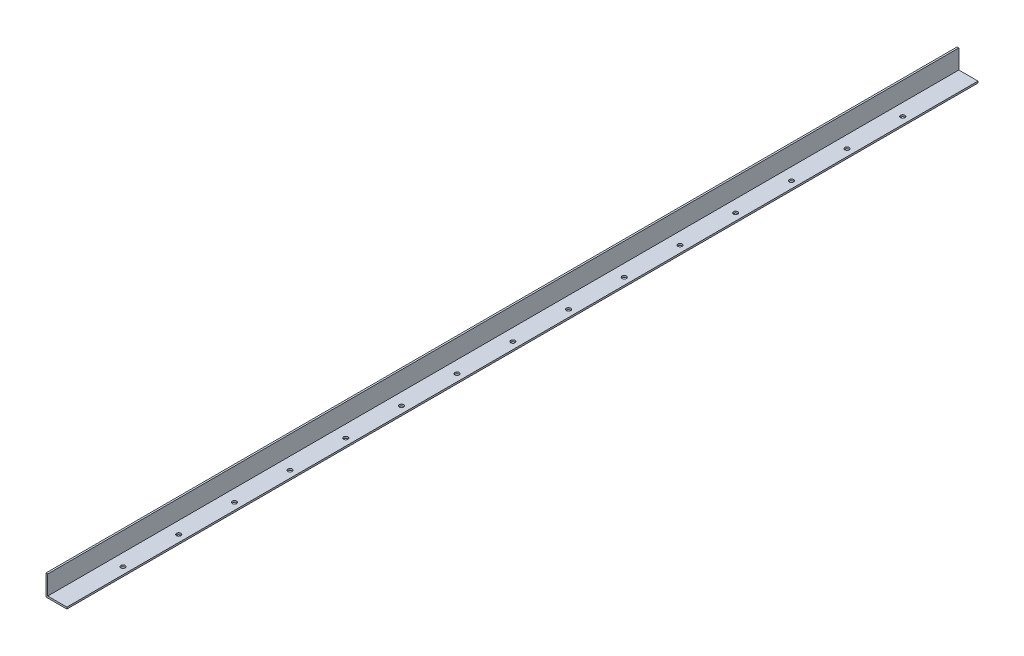
ISO-10303-21;
HEADER;
FILE_DESCRIPTION(('STEP AP214'),'2;1');
FILE_NAME('part.step','',(''),(''),'','','');
FILE_SCHEMA(('AUTOMOTIVE_DESIGN { 1 0 10303 214 1 1 1 1 }'));
ENDSEC;
DATA;
#1=APPLICATION_CONTEXT('core data for automotive mechanical design processes');
#2=APPLICATION_PROTOCOL_DEFINITION('international standard','automotive_design',2000,#1);
#3=PRODUCT_CONTEXT('',#1,'mechanical');
#4=PRODUCT('Part','Part','',(#3));
#5=PRODUCT_RELATED_PRODUCT_CATEGORY('part','',(#4));
#6=PRODUCT_DEFINITION_FORMATION('','',#4);
#7=PRODUCT_DEFINITION_CONTEXT('part definition',#1,'design');
#8=PRODUCT_DEFINITION('design','',#6,#7);
#9=PRODUCT_DEFINITION_SHAPE('','',#8);
#10=(LENGTH_UNIT() NAMED_UNIT(*) SI_UNIT(.MILLI.,.METRE.));
#11=(NAMED_UNIT(*) PLANE_ANGLE_UNIT() SI_UNIT($,.RADIAN.));
#12=(NAMED_UNIT(*) SI_UNIT($,.STERADIAN.) SOLID_ANGLE_UNIT());
#13=UNCERTAINTY_MEASURE_WITH_UNIT(LENGTH_MEASURE(1.E-05),#10,'distance_accuracy_value','');
#14=(GEOMETRIC_REPRESENTATION_CONTEXT(3) GLOBAL_UNCERTAINTY_ASSIGNED_CONTEXT((#13)) GLOBAL_UNIT_ASSIGNED_CONTEXT((#10,
#11,#12)) REPRESENTATION_CONTEXT('',''));
#15=CARTESIAN_POINT('',(0.,0.,0.));
#16=DIRECTION('',(0.,0.,1.));
#17=DIRECTION('',(1.,0.,0.));
#18=AXIS2_PLACEMENT_3D('',#15,#16,#17);
#19=CARTESIAN_POINT('',(25.4,-3.175,-706.4375));
#20=DIRECTION('',(0.,-1.,0.));
#21=DIRECTION('',(0.,0.,-1.));
#22=AXIS2_PLACEMENT_3D('',#19,#20,#21);
#23=CYLINDRICAL_SURFACE('',#22,3.96875);
#24=CARTESIAN_POINT('',(25.4,3.175,-706.4375));
#25=DIRECTION('',(0.,-1.,0.));
#26=DIRECTION('',(0.,0.,-1.));
#27=AXIS2_PLACEMENT_3D('',#24,#25,#26);
#28=CIRCLE('',#27,3.96875);
#29=CARTESIAN_POINT('',(25.4,3.175,-710.40625));
#30=VERTEX_POINT('',#29);
#31=EDGE_CURVE('E20',#30,#30,#28,.T.);
#32=ORIENTED_EDGE('',*,*,#31,.F.);
#33=EDGE_LOOP('',(#32));
#34=FACE_BOUND('',#33,.T.);
#35=CARTESIAN_POINT('',(25.4,0.,-706.4375));
#36=DIRECTION('',(0.,-1.,0.));
#37=DIRECTION('',(0.,0.,-1.));
#38=AXIS2_PLACEMENT_3D('',#35,#36,#37);
#39=CIRCLE('',#38,3.96875);
#40=CARTESIAN_POINT('',(25.4,0.,-710.40625));
#41=VERTEX_POINT('',#40);
#42=EDGE_CURVE('E101',#41,#41,#39,.F.);
#43=ORIENTED_EDGE('',*,*,#42,.F.);
#44=EDGE_LOOP('',(#43));
#45=FACE_BOUND('',#44,.T.);
#46=ADVANCED_FACE('F17',(#34,#45),#23,.F.);
#47=CARTESIAN_POINT('',(25.4,-3.175,-604.8375));
#48=DIRECTION('',(0.,-1.,0.));
#49=DIRECTION('',(0.,0.,-1.));
#50=AXIS2_PLACEMENT_3D('',#47,#48,#49);
#51=CYLINDRICAL_SURFACE('',#50,3.96875);
#52=CARTESIAN_POINT('',(25.4,3.175,-604.8375));
#53=DIRECTION('',(0.,-1.,0.));
#54=DIRECTION('',(0.,0.,-1.));
#55=AXIS2_PLACEMENT_3D('',#52,#53,#54);
#56=CIRCLE('',#55,3.96875);
#57=CARTESIAN_POINT('',(25.4,3.175,-608.80625));
#58=VERTEX_POINT('',#57);
#59=EDGE_CURVE('E181',#58,#58,#56,.T.);
#60=ORIENTED_EDGE('',*,*,#59,.F.);
#61=EDGE_LOOP('',(#60));
#62=FACE_BOUND('',#61,.T.);
#63=CARTESIAN_POINT('',(25.4,0.,-604.8375));
#64=DIRECTION('',(0.,-1.,0.));
#65=DIRECTION('',(0.,0.,-1.));
#66=AXIS2_PLACEMENT_3D('',#63,#64,#65);
#67=CIRCLE('',#66,3.96875);
#68=CARTESIAN_POINT('',(25.4,0.,-608.80625));
#69=VERTEX_POINT('',#68);
#70=EDGE_CURVE('E139',#69,#69,#67,.F.);
#71=ORIENTED_EDGE('',*,*,#70,.F.);
#72=EDGE_LOOP('',(#71));
#73=FACE_BOUND('',#72,.T.);
#74=ADVANCED_FACE('F191',(#62,#73),#51,.F.);
#75=CARTESIAN_POINT('',(25.4,-3.175,-503.2375));
#76=DIRECTION('',(0.,-1.,0.));
#77=DIRECTION('',(0.,0.,-1.));
#78=AXIS2_PLACEMENT_3D('',#75,#76,#77);
#79=CYLINDRICAL_SURFACE('',#78,3.96875);
#80=CARTESIAN_POINT('',(25.4,3.175,-503.2375));
#81=DIRECTION('',(0.,-1.,0.));
#82=DIRECTION('',(0.,0.,-1.));
#83=AXIS2_PLACEMENT_3D('',#80,#81,#82);
#84=CIRCLE('',#83,3.96875);
#85=CARTESIAN_POINT('',(25.4,3.175,-507.20625));
#86=VERTEX_POINT('',#85);
#87=EDGE_CURVE('E179',#86,#86,#84,.T.);
#88=ORIENTED_EDGE('',*,*,#87,.F.);
#89=EDGE_LOOP('',(#88));
#90=FACE_BOUND('',#89,.T.);
#91=CARTESIAN_POINT('',(25.4,0.,-503.2375));
#92=DIRECTION('',(0.,-1.,0.));
#93=DIRECTION('',(0.,0.,-1.));
#94=AXIS2_PLACEMENT_3D('',#91,#92,#93);
#95=CIRCLE('',#94,3.96875);
#96=CARTESIAN_POINT('',(25.4,0.,-507.20625));
#97=VERTEX_POINT('',#96);
#98=EDGE_CURVE('E136',#97,#97,#95,.F.);
#99=ORIENTED_EDGE('',*,*,#98,.F.);
#100=EDGE_LOOP('',(#99));
#101=FACE_BOUND('',#100,.T.);
#102=ADVANCED_FACE('F415',(#90,#101),#79,.F.);
#103=CARTESIAN_POINT('',(25.4,-3.175,-401.6375));
#104=DIRECTION('',(0.,-1.,0.));
#105=DIRECTION('',(0.,0.,-1.));
#106=AXIS2_PLACEMENT_3D('',#103,#104,#105);
#107=CYLINDRICAL_SURFACE('',#106,3.96875);
#108=CARTESIAN_POINT('',(25.4,3.175,-401.6375));
#109=DIRECTION('',(0.,-1.,0.));
#110=DIRECTION('',(0.,0.,-1.));
#111=AXIS2_PLACEMENT_3D('',#108,#109,#110);
#112=CIRCLE('',#111,3.96875);
#113=CARTESIAN_POINT('',(25.4,3.175,-405.60625));
#114=VERTEX_POINT('',#113);
#115=EDGE_CURVE('E176',#114,#114,#112,.T.);
#116=ORIENTED_EDGE('',*,*,#115,.F.);
#117=EDGE_LOOP('',(#116));
#118=FACE_BOUND('',#117,.T.);
#119=CARTESIAN_POINT('',(25.4,0.,-401.6375));
#120=DIRECTION('',(0.,-1.,0.));
#121=DIRECTION('',(0.,0.,-1.));
#122=AXIS2_PLACEMENT_3D('',#119,#120,#121);
#123=CIRCLE('',#122,3.96875);
#124=CARTESIAN_POINT('',(25.4,0.,-405.60625));
#125=VERTEX_POINT('',#124);
#126=EDGE_CURVE('E133',#125,#125,#123,.F.);
#127=ORIENTED_EDGE('',*,*,#126,.F.);
#128=EDGE_LOOP('',(#127));
#129=FACE_BOUND('',#128,.T.);
#130=ADVANCED_FACE('F405',(#118,#129),#107,.F.);
#131=CARTESIAN_POINT('',(25.4,-3.175,-300.0375));
#132=DIRECTION('',(0.,-1.,0.));
#133=DIRECTION('',(0.,0.,-1.));
#134=AXIS2_PLACEMENT_3D('',#131,#132,#133);
#135=CYLINDRICAL_SURFACE('',#134,3.96875);
#136=CARTESIAN_POINT('',(25.4,3.175,-300.0375));
#137=DIRECTION('',(0.,-1.,0.));
#138=DIRECTION('',(0.,0.,-1.));
#139=AXIS2_PLACEMENT_3D('',#136,#137,#138);
#140=CIRCLE('',#139,3.96875);
#141=CARTESIAN_POINT('',(25.4,3.175,-304.00625));
#142=VERTEX_POINT('',#141);
#143=EDGE_CURVE('E173',#142,#142,#140,.T.);
#144=ORIENTED_EDGE('',*,*,#143,.F.);
#145=EDGE_LOOP('',(#144));
#146=FACE_BOUND('',#145,.T.);
#147=CARTESIAN_POINT('',(25.4,0.,-300.0375));
#148=DIRECTION('',(0.,-1.,0.));
#149=DIRECTION('',(0.,0.,-1.));
#150=AXIS2_PLACEMENT_3D('',#147,#148,#149);
#151=CIRCLE('',#150,3.96875);
#152=CARTESIAN_POINT('',(25.4,0.,-304.00625));
#153=VERTEX_POINT('',#152);
#154=EDGE_CURVE('E130',#153,#153,#151,.F.);
#155=ORIENTED_EDGE('',*,*,#154,.F.);
#156=EDGE_LOOP('',(#155));
#157=FACE_BOUND('',#156,.T.);
#158=ADVANCED_FACE('F395',(#146,#157),#135,.F.);
#159=CARTESIAN_POINT('',(25.4,-3.175,-198.4375));
#160=DIRECTION('',(0.,-1.,0.));
#161=DIRECTION('',(0.,0.,-1.));
#162=AXIS2_PLACEMENT_3D('',#159,#160,#161);
#163=CYLINDRICAL_SURFACE('',#162,3.96875);
#164=CARTESIAN_POINT('',(25.4,3.175,-198.4375));
#165=DIRECTION('',(0.,-1.,0.));
#166=DIRECTION('',(0.,0.,-1.));
#167=AXIS2_PLACEMENT_3D('',#164,#165,#166);
#168=CIRCLE('',#167,3.96875);
#169=CARTESIAN_POINT('',(25.4,3.175,-202.40625));
#170=VERTEX_POINT('',#169);
#171=EDGE_CURVE('E170',#170,#170,#168,.T.);
#172=ORIENTED_EDGE('',*,*,#171,.F.);
#173=EDGE_LOOP('',(#172));
#174=FACE_BOUND('',#173,.T.);
#175=CARTESIAN_POINT('',(25.4,0.,-198.4375));
#176=DIRECTION('',(0.,-1.,0.));
#177=DIRECTION('',(0.,0.,-1.));
#178=AXIS2_PLACEMENT_3D('',#175,#176,#177);
#179=CIRCLE('',#178,3.96875);
#180=CARTESIAN_POINT('',(25.4,0.,-202.40625));
#181=VERTEX_POINT('',#180);
#182=EDGE_CURVE('E127',#181,#181,#179,.F.);
#183=ORIENTED_EDGE('',*,*,#182,.F.);
#184=EDGE_LOOP('',(#183));
#185=FACE_BOUND('',#184,.T.);
#186=ADVANCED_FACE('F385',(#174,#185),#163,.F.);
#187=CARTESIAN_POINT('',(25.4,-3.175,-96.8375));
#188=DIRECTION('',(0.,-1.,0.));
#189=DIRECTION('',(0.,0.,-1.));
#190=AXIS2_PLACEMENT_3D('',#187,#188,#189);
#191=CYLINDRICAL_SURFACE('',#190,3.96875);
#192=CARTESIAN_POINT('',(25.4,3.175,-96.8375));
#193=DIRECTION('',(0.,-1.,0.));
#194=DIRECTION('',(0.,0.,-1.));
#195=AXIS2_PLACEMENT_3D('',#192,#193,#194);
#196=CIRCLE('',#195,3.96875);
#197=CARTESIAN_POINT('',(25.4,3.175,-100.80625));
#198=VERTEX_POINT('',#197);
#199=EDGE_CURVE('E167',#198,#198,#196,.T.);
#200=ORIENTED_EDGE('',*,*,#199,.F.);
#201=EDGE_LOOP('',(#200));
#202=FACE_BOUND('',#201,.T.);
#203=CARTESIAN_POINT('',(25.4,0.,-96.8375));
#204=DIRECTION('',(0.,-1.,0.));
#205=DIRECTION('',(0.,0.,-1.));
#206=AXIS2_PLACEMENT_3D('',#203,#204,#205);
#207=CIRCLE('',#206,3.96875);
#208=CARTESIAN_POINT('',(25.4,0.,-100.80625));
#209=VERTEX_POINT('',#208);
#210=EDGE_CURVE('E124',#209,#209,#207,.F.);
#211=ORIENTED_EDGE('',*,*,#210,.F.);
#212=EDGE_LOOP('',(#211));
#213=FACE_BOUND('',#212,.T.);
#214=ADVANCED_FACE('F375',(#202,#213),#191,.F.);
#215=CARTESIAN_POINT('',(25.4,-3.175,4.7625));
#216=DIRECTION('',(0.,-1.,0.));
#217=DIRECTION('',(0.,0.,-1.));
#218=AXIS2_PLACEMENT_3D('',#215,#216,#217);
#219=CYLINDRICAL_SURFACE('',#218,3.96875);
#220=CARTESIAN_POINT('',(25.4,3.175,4.7625));
#221=DIRECTION('',(0.,-1.,0.));
#222=DIRECTION('',(0.,0.,-1.));
#223=AXIS2_PLACEMENT_3D('',#220,#221,#222);
#224=CIRCLE('',#223,3.96875);
#225=CARTESIAN_POINT('',(25.4,3.175,0.793749999999999));
#226=VERTEX_POINT('',#225);
#227=EDGE_CURVE('E164',#226,#226,#224,.T.);
#228=ORIENTED_EDGE('',*,*,#227,.F.);
#229=EDGE_LOOP('',(#228));
#230=FACE_BOUND('',#229,.T.);
#231=CARTESIAN_POINT('',(25.4,0.,4.7625));
#232=DIRECTION('',(0.,-1.,0.));
#233=DIRECTION('',(0.,0.,-1.));
#234=AXIS2_PLACEMENT_3D('',#231,#232,#233);
#235=CIRCLE('',#234,3.96875);
#236=CARTESIAN_POINT('',(25.4,0.,0.793749999999999));
#237=VERTEX_POINT('',#236);
#238=EDGE_CURVE('E121',#237,#237,#235,.F.);
#239=ORIENTED_EDGE('',*,*,#238,.F.);
#240=EDGE_LOOP('',(#239));
#241=FACE_BOUND('',#240,.T.);
#242=ADVANCED_FACE('F365',(#230,#241),#219,.F.);
#243=CARTESIAN_POINT('',(25.4,-3.175,106.3625));
#244=DIRECTION('',(0.,-1.,0.));
#245=DIRECTION('',(0.,0.,-1.));
#246=AXIS2_PLACEMENT_3D('',#243,#244,#245);
#247=CYLINDRICAL_SURFACE('',#246,3.96875);
#248=CARTESIAN_POINT('',(25.4,3.175,106.3625));
#249=DIRECTION('',(0.,-1.,0.));
#250=DIRECTION('',(0.,0.,-1.));
#251=AXIS2_PLACEMENT_3D('',#248,#249,#250);
#252=CIRCLE('',#251,3.96875);
#253=CARTESIAN_POINT('',(25.4,3.175,102.39375));
#254=VERTEX_POINT('',#253);
#255=EDGE_CURVE('E161',#254,#254,#252,.T.);
#256=ORIENTED_EDGE('',*,*,#255,.F.);
#257=EDGE_LOOP('',(#256));
#258=FACE_BOUND('',#257,.T.);
#259=CARTESIAN_POINT('',(25.4,0.,106.3625));
#260=DIRECTION('',(0.,-1.,0.));
#261=DIRECTION('',(0.,0.,-1.));
#262=AXIS2_PLACEMENT_3D('',#259,#260,#261);
#263=CIRCLE('',#262,3.96875);
#264=CARTESIAN_POINT('',(25.4,0.,102.39375));
#265=VERTEX_POINT('',#264);
#266=EDGE_CURVE('E118',#265,#265,#263,.F.);
#267=ORIENTED_EDGE('',*,*,#266,.F.);
#268=EDGE_LOOP('',(#267));
#269=FACE_BOUND('',#268,.T.);
#270=ADVANCED_FACE('F355',(#258,#269),#247,.F.);
#271=CARTESIAN_POINT('',(25.4,-3.175,207.9625));
#272=DIRECTION('',(0.,-1.,0.));
#273=DIRECTION('',(0.,0.,-1.));
#274=AXIS2_PLACEMENT_3D('',#271,#272,#273);
#275=CYLINDRICAL_SURFACE('',#274,3.96875);
#276=CARTESIAN_POINT('',(25.4,3.175,207.9625));
#277=DIRECTION('',(0.,-1.,0.));
#278=DIRECTION('',(0.,0.,-1.));
#279=AXIS2_PLACEMENT_3D('',#276,#277,#278);
#280=CIRCLE('',#279,3.96875);
#281=CARTESIAN_POINT('',(25.4,3.175,203.99375));
#282=VERTEX_POINT('',#281);
#283=EDGE_CURVE('E158',#282,#282,#280,.T.);
#284=ORIENTED_EDGE('',*,*,#283,.F.);
#285=EDGE_LOOP('',(#284));
#286=FACE_BOUND('',#285,.T.);
#287=CARTESIAN_POINT('',(25.4,0.,207.9625));
#288=DIRECTION('',(0.,-1.,0.));
#289=DIRECTION('',(0.,0.,-1.));
#290=AXIS2_PLACEMENT_3D('',#287,#288,#289);
#291=CIRCLE('',#290,3.96875);
#292=CARTESIAN_POINT('',(25.4,0.,203.99375));
#293=VERTEX_POINT('',#292);
#294=EDGE_CURVE('E115',#293,#293,#291,.F.);
#295=ORIENTED_EDGE('',*,*,#294,.F.);
#296=EDGE_LOOP('',(#295));
#297=FACE_BOUND('',#296,.T.);
#298=ADVANCED_FACE('F345',(#286,#297),#275,.F.);
#299=CARTESIAN_POINT('',(25.4,-3.175,309.5625));
#300=DIRECTION('',(0.,-1.,0.));
#301=DIRECTION('',(0.,0.,-1.));
#302=AXIS2_PLACEMENT_3D('',#299,#300,#301);
#303=CYLINDRICAL_SURFACE('',#302,3.96875);
#304=CARTESIAN_POINT('',(25.4,3.175,309.5625));
#305=DIRECTION('',(0.,-1.,0.));
#306=DIRECTION('',(0.,0.,-1.));
#307=AXIS2_PLACEMENT_3D('',#304,#305,#306);
#308=CIRCLE('',#307,3.96875);
#309=CARTESIAN_POINT('',(25.4,3.175,305.59375));
#310=VERTEX_POINT('',#309);
#311=EDGE_CURVE('E155',#310,#310,#308,.T.);
#312=ORIENTED_EDGE('',*,*,#311,.F.);
#313=EDGE_LOOP('',(#312));
#314=FACE_BOUND('',#313,.T.);
#315=CARTESIAN_POINT('',(25.4,0.,309.5625));
#316=DIRECTION('',(0.,-1.,0.));
#317=DIRECTION('',(0.,0.,-1.));
#318=AXIS2_PLACEMENT_3D('',#315,#316,#317);
#319=CIRCLE('',#318,3.96875);
#320=CARTESIAN_POINT('',(25.4,0.,305.59375));
#321=VERTEX_POINT('',#320);
#322=EDGE_CURVE('E112',#321,#321,#319,.F.);
#323=ORIENTED_EDGE('',*,*,#322,.F.);
#324=EDGE_LOOP('',(#323));
#325=FACE_BOUND('',#324,.T.);
#326=ADVANCED_FACE('F335',(#314,#325),#303,.F.);
#327=CARTESIAN_POINT('',(25.4,-3.175,411.1625));
#328=DIRECTION('',(0.,-1.,0.));
#329=DIRECTION('',(0.,0.,-1.));
#330=AXIS2_PLACEMENT_3D('',#327,#328,#329);
#331=CYLINDRICAL_SURFACE('',#330,3.96875);
#332=CARTESIAN_POINT('',(25.4,3.175,411.1625));
#333=DIRECTION('',(0.,-1.,0.));
#334=DIRECTION('',(0.,0.,-1.));
#335=AXIS2_PLACEMENT_3D('',#332,#333,#334);
#336=CIRCLE('',#335,3.96875);
#337=CARTESIAN_POINT('',(25.4,3.175,407.19375));
#338=VERTEX_POINT('',#337);
#339=EDGE_CURVE('E152',#338,#338,#336,.T.);
#340=ORIENTED_EDGE('',*,*,#339,.F.);
#341=EDGE_LOOP('',(#340));
#342=FACE_BOUND('',#341,.T.);
#343=CARTESIAN_POINT('',(25.4,0.,411.1625));
#344=DIRECTION('',(0.,-1.,0.));
#345=DIRECTION('',(0.,0.,-1.));
#346=AXIS2_PLACEMENT_3D('',#343,#344,#345);
#347=CIRCLE('',#346,3.96875);
#348=CARTESIAN_POINT('',(25.4,0.,407.19375));
#349=VERTEX_POINT('',#348);
#350=EDGE_CURVE('E109',#349,#349,#347,.F.);
#351=ORIENTED_EDGE('',*,*,#350,.F.);
#352=EDGE_LOOP('',(#351));
#353=FACE_BOUND('',#352,.T.);
#354=ADVANCED_FACE('F325',(#342,#353),#331,.F.);
#355=CARTESIAN_POINT('',(25.4,-3.175,512.7625));
#356=DIRECTION('',(0.,-1.,0.));
#357=DIRECTION('',(0.,0.,-1.));
#358=AXIS2_PLACEMENT_3D('',#355,#356,#357);
#359=CYLINDRICAL_SURFACE('',#358,3.96875);
#360=CARTESIAN_POINT('',(25.4,3.175,512.7625));
#361=DIRECTION('',(0.,-1.,0.));
#362=DIRECTION('',(0.,0.,-1.));
#363=AXIS2_PLACEMENT_3D('',#360,#361,#362);
#364=CIRCLE('',#363,3.96875);
#365=CARTESIAN_POINT('',(25.4,3.175,508.79375));
#366=VERTEX_POINT('',#365);
#367=EDGE_CURVE('E149',#366,#366,#364,.T.);
#368=ORIENTED_EDGE('',*,*,#367,.F.);
#369=EDGE_LOOP('',(#368));
#370=FACE_BOUND('',#369,.T.);
#371=CARTESIAN_POINT('',(25.4,0.,512.7625));
#372=DIRECTION('',(0.,-1.,0.));
#373=DIRECTION('',(0.,0.,-1.));
#374=AXIS2_PLACEMENT_3D('',#371,#372,#373);
#375=CIRCLE('',#374,3.96875);
#376=CARTESIAN_POINT('',(25.4,0.,508.79375));
#377=VERTEX_POINT('',#376);
#378=EDGE_CURVE('E106',#377,#377,#375,.F.);
#379=ORIENTED_EDGE('',*,*,#378,.F.);
#380=EDGE_LOOP('',(#379));
#381=FACE_BOUND('',#380,.T.);
#382=ADVANCED_FACE('F315',(#370,#381),#359,.F.);
#383=CARTESIAN_POINT('',(25.4,-3.175,614.3625));
#384=DIRECTION('',(0.,-1.,0.));
#385=DIRECTION('',(0.,0.,-1.));
#386=AXIS2_PLACEMENT_3D('',#383,#384,#385);
#387=CYLINDRICAL_SURFACE('',#386,3.96875);
#388=CARTESIAN_POINT('',(25.4,3.175,614.3625));
#389=DIRECTION('',(0.,-1.,0.));
#390=DIRECTION('',(0.,0.,-1.));
#391=AXIS2_PLACEMENT_3D('',#388,#389,#390);
#392=CIRCLE('',#391,3.96875);
#393=CARTESIAN_POINT('',(25.4,3.175,610.39375));
#394=VERTEX_POINT('',#393);
#395=EDGE_CURVE('E146',#394,#394,#392,.T.);
#396=ORIENTED_EDGE('',*,*,#395,.F.);
#397=EDGE_LOOP('',(#396));
#398=FACE_BOUND('',#397,.T.);
#399=CARTESIAN_POINT('',(25.4,0.,614.3625));
#400=DIRECTION('',(0.,-1.,0.));
#401=DIRECTION('',(0.,0.,-1.));
#402=AXIS2_PLACEMENT_3D('',#399,#400,#401);
#403=CIRCLE('',#402,3.96875);
#404=CARTESIAN_POINT('',(25.4,0.,610.39375));
#405=VERTEX_POINT('',#404);
#406=EDGE_CURVE('E95',#405,#405,#403,.F.);
#407=ORIENTED_EDGE('',*,*,#406,.F.);
#408=EDGE_LOOP('',(#407));
#409=FACE_BOUND('',#408,.T.);
#410=ADVANCED_FACE('F305',(#398,#409),#387,.F.);
#411=CARTESIAN_POINT('',(25.4,-3.175,715.9625));
#412=DIRECTION('',(0.,-1.,0.));
#413=DIRECTION('',(0.,0.,-1.));
#414=AXIS2_PLACEMENT_3D('',#411,#412,#413);
#415=CYLINDRICAL_SURFACE('',#414,3.96875);
#416=CARTESIAN_POINT('',(25.4,3.175,715.9625));
#417=DIRECTION('',(0.,-1.,0.));
#418=DIRECTION('',(0.,0.,-1.));
#419=AXIS2_PLACEMENT_3D('',#416,#417,#418);
#420=CIRCLE('',#419,3.96875);
#421=CARTESIAN_POINT('',(25.4,3.175,711.99375));
#422=VERTEX_POINT('',#421);
#423=EDGE_CURVE('E102',#422,#422,#420,.T.);
#424=ORIENTED_EDGE('',*,*,#423,.F.);
#425=EDGE_LOOP('',(#424));
#426=FACE_BOUND('',#425,.T.);
#427=CARTESIAN_POINT('',(25.4,0.,715.9625));
#428=DIRECTION('',(0.,-1.,0.));
#429=DIRECTION('',(0.,0.,-1.));
#430=AXIS2_PLACEMENT_3D('',#427,#428,#429);
#431=CIRCLE('',#430,3.96875);
#432=CARTESIAN_POINT('',(25.4,0.,711.99375));
#433=VERTEX_POINT('',#432);
#434=EDGE_CURVE('E92',#433,#433,#431,.F.);
#435=ORIENTED_EDGE('',*,*,#434,.F.);
#436=EDGE_LOOP('',(#435));
#437=FACE_BOUND('',#436,.T.);
#438=ADVANCED_FACE('F296',(#426,#437),#415,.F.);
#439=CARTESIAN_POINT('',(38.1,0.,-831.05625));
#440=DIRECTION('',(1.,0.,0.));
#441=DIRECTION('',(0.,0.,-1.));
#442=AXIS2_PLACEMENT_3D('',#439,#440,#441);
#443=PLANE('',#442);
#444=DIRECTION('',(0.,0.,-1.));
#445=VECTOR('',#444,1.);
#446=CARTESIAN_POINT('',(38.1,0.,-831.05625));
#447=LINE('',#446,#445);
#448=CARTESIAN_POINT('',(38.1,0.,-831.05625));
#449=VERTEX_POINT('',#448);
#450=CARTESIAN_POINT('',(38.1,0.,831.05625));
#451=VERTEX_POINT('',#450);
#452=EDGE_CURVE('E99',#449,#451,#447,.F.);
#453=ORIENTED_EDGE('',*,*,#452,.F.);
#454=DIRECTION('',(0.,1.,0.));
#455=VECTOR('',#454,1.);
#456=CARTESIAN_POINT('',(38.1,0.,-831.05625));
#457=LINE('',#456,#455);
#458=CARTESIAN_POINT('',(38.1,3.175,-831.05625));
#459=VERTEX_POINT('',#458);
#460=EDGE_CURVE('E75',#449,#459,#457,.T.);
#461=ORIENTED_EDGE('',*,*,#460,.T.);
#462=DIRECTION('',(0.,0.,1.));
#463=VECTOR('',#462,1.);
#464=CARTESIAN_POINT('',(38.1,3.175,-831.05625));
#465=LINE('',#464,#463);
#466=CARTESIAN_POINT('',(38.1,3.175,831.05625));
#467=VERTEX_POINT('',#466);
#468=EDGE_CURVE('E71',#467,#459,#465,.F.);
#469=ORIENTED_EDGE('',*,*,#468,.F.);
#470=DIRECTION('',(0.,1.,0.));
#471=VECTOR('',#470,1.);
#472=CARTESIAN_POINT('',(38.1,0.,831.05625));
#473=LINE('',#472,#471);
#474=EDGE_CURVE('E68',#451,#467,#473,.T.);
#475=ORIENTED_EDGE('',*,*,#474,.F.);
#476=EDGE_LOOP('',(#453,#461,#469,#475));
#477=FACE_BOUND('',#476,.T.);
#478=ADVANCED_FACE('F73',(#477),#443,.T.);
#479=CARTESIAN_POINT('',(38.1,3.175,-831.05625));
#480=DIRECTION('',(0.,1.,0.));
#481=DIRECTION('',(0.,0.,1.));
#482=AXIS2_PLACEMENT_3D('',#479,#480,#481);
#483=PLANE('',#482);
#484=ORIENTED_EDGE('',*,*,#423,.T.);
#485=EDGE_LOOP('',(#484));
#486=FACE_BOUND('',#485,.T.);
#487=ORIENTED_EDGE('',*,*,#395,.T.);
#488=EDGE_LOOP('',(#487));
#489=FACE_BOUND('',#488,.T.);
#490=ORIENTED_EDGE('',*,*,#367,.T.);
#491=EDGE_LOOP('',(#490));
#492=FACE_BOUND('',#491,.T.);
#493=ORIENTED_EDGE('',*,*,#339,.T.);
#494=EDGE_LOOP('',(#493));
#495=FACE_BOUND('',#494,.T.);
#496=ORIENTED_EDGE('',*,*,#311,.T.);
#497=EDGE_LOOP('',(#496));
#498=FACE_BOUND('',#497,.T.);
#499=ORIENTED_EDGE('',*,*,#283,.T.);
#500=EDGE_LOOP('',(#499));
#501=FACE_BOUND('',#500,.T.);
#502=ORIENTED_EDGE('',*,*,#255,.T.);
#503=EDGE_LOOP('',(#502));
#504=FACE_BOUND('',#503,.T.);
#505=ORIENTED_EDGE('',*,*,#227,.T.);
#506=EDGE_LOOP('',(#505));
#507=FACE_BOUND('',#506,.T.);
#508=ORIENTED_EDGE('',*,*,#199,.T.);
#509=EDGE_LOOP('',(#508));
#510=FACE_BOUND('',#509,.T.);
#511=ORIENTED_EDGE('',*,*,#171,.T.);
#512=EDGE_LOOP('',(#511));
#513=FACE_BOUND('',#512,.T.);
#514=ORIENTED_EDGE('',*,*,#143,.T.);
#515=EDGE_LOOP('',(#514));
#516=FACE_BOUND('',#515,.T.);
#517=ORIENTED_EDGE('',*,*,#115,.T.);
#518=EDGE_LOOP('',(#517));
#519=FACE_BOUND('',#518,.T.);
#520=ORIENTED_EDGE('',*,*,#87,.T.);
#521=EDGE_LOOP('',(#520));
#522=FACE_BOUND('',#521,.T.);
#523=ORIENTED_EDGE('',*,*,#59,.T.);
#524=EDGE_LOOP('',(#523));
#525=FACE_BOUND('',#524,.T.);
#526=ORIENTED_EDGE('',*,*,#31,.T.);
#527=EDGE_LOOP('',(#526));
#528=FACE_BOUND('',#527,.T.);
#529=ORIENTED_EDGE('',*,*,#468,.T.);
#530=DIRECTION('',(1.,0.,0.));
#531=VECTOR('',#530,1.);
#532=CARTESIAN_POINT('',(0.,3.175,-831.05625));
#533=LINE('',#532,#531);
#534=CARTESIAN_POINT('',(3.175,3.175,-831.05625));
#535=VERTEX_POINT('',#534);
#536=EDGE_CURVE('E222',#459,#535,#533,.F.);
#537=ORIENTED_EDGE('',*,*,#536,.T.);
#538=DIRECTION('',(0.,0.,-1.));
#539=VECTOR('',#538,1.);
#540=CARTESIAN_POINT('',(3.175,3.175,-831.05625));
#541=LINE('',#540,#539);
#542=CARTESIAN_POINT('',(3.175,3.175,831.05625));
#543=VERTEX_POINT('',#542);
#544=EDGE_CURVE('E83',#543,#535,#541,.T.);
#545=ORIENTED_EDGE('',*,*,#544,.F.);
#546=DIRECTION('',(1.,0.,0.));
#547=VECTOR('',#546,1.);
#548=CARTESIAN_POINT('',(0.,3.175,831.05625));
#549=LINE('',#548,#547);
#550=EDGE_CURVE('E80',#467,#543,#549,.F.);
#551=ORIENTED_EDGE('',*,*,#550,.F.);
#552=EDGE_LOOP('',(#529,#537,#545,#551));
#553=FACE_BOUND('',#552,.T.);
#554=ADVANCED_FACE('F81',(#486,#489,#492,#495,#498,#501,#504,#507,#510,#513,#516,#519,#522,#525,
#528,#553),#483,.T.);
#555=CARTESIAN_POINT('',(3.175,3.175,-831.05625));
#556=DIRECTION('',(1.,0.,0.));
#557=DIRECTION('',(0.,0.,-1.));
#558=AXIS2_PLACEMENT_3D('',#555,#556,#557);
#559=PLANE('',#558);
#560=ORIENTED_EDGE('',*,*,#544,.T.);
#561=DIRECTION('',(0.,1.,0.));
#562=VECTOR('',#561,1.);
#563=CARTESIAN_POINT('',(3.175,0.,-831.05625));
#564=LINE('',#563,#562);
#565=CARTESIAN_POINT('',(3.175,38.1,-831.05625));
#566=VERTEX_POINT('',#565);
#567=EDGE_CURVE('E220',#535,#566,#564,.T.);
#568=ORIENTED_EDGE('',*,*,#567,.T.);
#569=DIRECTION('',(0.,0.,1.));
#570=VECTOR('',#569,1.);
#571=CARTESIAN_POINT('',(3.175,38.1,-831.05625));
#572=LINE('',#571,#570);
#573=CARTESIAN_POINT('',(3.175,38.1,831.05625));
#574=VERTEX_POINT('',#573);
#575=EDGE_CURVE('E212',#574,#566,#572,.F.);
#576=ORIENTED_EDGE('',*,*,#575,.F.);
#577=DIRECTION('',(0.,1.,0.));
#578=VECTOR('',#577,1.);
#579=CARTESIAN_POINT('',(3.175,0.,831.05625));
#580=LINE('',#579,#578);
#581=EDGE_CURVE('E86',#543,#574,#580,.T.);
#582=ORIENTED_EDGE('',*,*,#581,.F.);
#583=EDGE_LOOP('',(#560,#568,#576,#582));
#584=FACE_BOUND('',#583,.T.);
#585=ADVANCED_FACE('F197',(#584),#559,.T.);
#586=CARTESIAN_POINT('',(0.,0.,-831.05625));
#587=DIRECTION('',(0.,-1.,0.));
#588=DIRECTION('',(0.,0.,-1.));
#589=AXIS2_PLACEMENT_3D('',#586,#587,#588);
#590=PLANE('',#589);
#591=ORIENTED_EDGE('',*,*,#434,.T.);
#592=EDGE_LOOP('',(#591));
#593=FACE_BOUND('',#592,.T.);
#594=ORIENTED_EDGE('',*,*,#406,.T.);
#595=EDGE_LOOP('',(#594));
#596=FACE_BOUND('',#595,.T.);
#597=ORIENTED_EDGE('',*,*,#378,.T.);
#598=EDGE_LOOP('',(#597));
#599=FACE_BOUND('',#598,.T.);
#600=ORIENTED_EDGE('',*,*,#350,.T.);
#601=EDGE_LOOP('',(#600));
#602=FACE_BOUND('',#601,.T.);
#603=ORIENTED_EDGE('',*,*,#322,.T.);
#604=EDGE_LOOP('',(#603));
#605=FACE_BOUND('',#604,.T.);
#606=ORIENTED_EDGE('',*,*,#294,.T.);
#607=EDGE_LOOP('',(#606));
#608=FACE_BOUND('',#607,.T.);
#609=ORIENTED_EDGE('',*,*,#266,.T.);
#610=EDGE_LOOP('',(#609));
#611=FACE_BOUND('',#610,.T.);
#612=ORIENTED_EDGE('',*,*,#238,.T.);
#613=EDGE_LOOP('',(#612));
#614=FACE_BOUND('',#613,.T.);
#615=ORIENTED_EDGE('',*,*,#210,.T.);
#616=EDGE_LOOP('',(#615));
#617=FACE_BOUND('',#616,.T.);
#618=ORIENTED_EDGE('',*,*,#182,.T.);
#619=EDGE_LOOP('',(#618));
#620=FACE_BOUND('',#619,.T.);
#621=ORIENTED_EDGE('',*,*,#154,.T.);
#622=EDGE_LOOP('',(#621));
#623=FACE_BOUND('',#622,.T.);
#624=ORIENTED_EDGE('',*,*,#126,.T.);
#625=EDGE_LOOP('',(#624));
#626=FACE_BOUND('',#625,.T.);
#627=ORIENTED_EDGE('',*,*,#98,.T.);
#628=EDGE_LOOP('',(#627));
#629=FACE_BOUND('',#628,.T.);
#630=ORIENTED_EDGE('',*,*,#70,.T.);
#631=EDGE_LOOP('',(#630));
#632=FACE_BOUND('',#631,.T.);
#633=ORIENTED_EDGE('',*,*,#42,.T.);
#634=EDGE_LOOP('',(#633));
#635=FACE_BOUND('',#634,.T.);
#636=DIRECTION('',(0.,0.,1.));
#637=VECTOR('',#636,1.);
#638=CARTESIAN_POINT('',(0.,0.,-831.05625));
#639=LINE('',#638,#637);
#640=CARTESIAN_POINT('',(0.,0.,-831.05625));
#641=VERTEX_POINT('',#640);
#642=CARTESIAN_POINT('',(0.,0.,831.05625));
#643=VERTEX_POINT('',#642);
#644=EDGE_CURVE('E202',#641,#643,#639,.T.);
#645=ORIENTED_EDGE('',*,*,#644,.F.);
#646=DIRECTION('',(1.,0.,0.));
#647=VECTOR('',#646,1.);
#648=CARTESIAN_POINT('',(0.,0.,-831.05625));
#649=LINE('',#648,#647);
#650=EDGE_CURVE('E204',#641,#449,#649,.T.);
#651=ORIENTED_EDGE('',*,*,#650,.T.);
#652=ORIENTED_EDGE('',*,*,#452,.T.);
#653=DIRECTION('',(1.,0.,0.));
#654=VECTOR('',#653,1.);
#655=CARTESIAN_POINT('',(0.,0.,831.05625));
#656=LINE('',#655,#654);
#657=EDGE_CURVE('E91',#643,#451,#656,.T.);
#658=ORIENTED_EDGE('',*,*,#657,.F.);
#659=EDGE_LOOP('',(#645,#651,#652,#658));
#660=FACE_BOUND('',#659,.T.);
#661=ADVANCED_FACE('F194',(#593,#596,#599,#602,#605,#608,#611,#614,#617,#620,#623,#626,#629,
#632,#635,#660),#590,.T.);
#662=CARTESIAN_POINT('',(0.,0.,831.05625));
#663=DIRECTION('',(0.,0.,1.));
#664=DIRECTION('',(1.,0.,0.));
#665=AXIS2_PLACEMENT_3D('',#662,#663,#664);
#666=PLANE('',#665);
#667=DIRECTION('',(0.,1.,0.));
#668=VECTOR('',#667,1.);
#669=CARTESIAN_POINT('',(0.,38.1,831.05625));
#670=LINE('',#669,#668);
#671=CARTESIAN_POINT('',(0.,38.1,831.05625));
#672=VERTEX_POINT('',#671);
#673=EDGE_CURVE('E207',#643,#672,#670,.T.);
#674=ORIENTED_EDGE('',*,*,#673,.F.);
#675=ORIENTED_EDGE('',*,*,#657,.T.);
#676=ORIENTED_EDGE('',*,*,#474,.T.);
#677=ORIENTED_EDGE('',*,*,#550,.T.);
#678=ORIENTED_EDGE('',*,*,#581,.T.);
#679=DIRECTION('',(1.,0.,0.));
#680=VECTOR('',#679,1.);
#681=CARTESIAN_POINT('',(3.175,38.1,831.05625));
#682=LINE('',#681,#680);
#683=EDGE_CURVE('E226',#672,#574,#682,.T.);
#684=ORIENTED_EDGE('',*,*,#683,.F.);
#685=EDGE_LOOP('',(#674,#675,#676,#677,#678,#684));
#686=FACE_BOUND('',#685,.T.);
#687=ADVANCED_FACE('F90',(#686),#666,.T.);
#688=CARTESIAN_POINT('',(3.175,38.1,-831.05625));
#689=DIRECTION('',(0.,1.,0.));
#690=DIRECTION('',(0.,0.,1.));
#691=AXIS2_PLACEMENT_3D('',#688,#689,#690);
#692=PLANE('',#691);
#693=ORIENTED_EDGE('',*,*,#575,.T.);
#694=DIRECTION('',(1.,0.,0.));
#695=VECTOR('',#694,1.);
#696=CARTESIAN_POINT('',(0.,38.1,-831.05625));
#697=LINE('',#696,#695);
#698=CARTESIAN_POINT('',(0.,38.1,-831.05625));
#699=VERTEX_POINT('',#698);
#700=EDGE_CURVE('E35',#566,#699,#697,.F.);
#701=ORIENTED_EDGE('',*,*,#700,.T.);
#702=DIRECTION('',(0.,0.,1.));
#703=VECTOR('',#702,1.);
#704=CARTESIAN_POINT('',(0.,38.1,-831.05625));
#705=LINE('',#704,#703);
#706=EDGE_CURVE('E26',#672,#699,#705,.F.);
#707=ORIENTED_EDGE('',*,*,#706,.F.);
#708=ORIENTED_EDGE('',*,*,#683,.T.);
#709=EDGE_LOOP('',(#693,#701,#707,#708));
#710=FACE_BOUND('',#709,.T.);
#711=ADVANCED_FACE('F231',(#710),#692,.T.);
#712=CARTESIAN_POINT('',(0.,0.,-831.05625));
#713=DIRECTION('',(0.,0.,1.));
#714=DIRECTION('',(1.,0.,0.));
#715=AXIS2_PLACEMENT_3D('',#712,#713,#714);
#716=PLANE('',#715);
#717=ORIENTED_EDGE('',*,*,#700,.F.);
#718=ORIENTED_EDGE('',*,*,#567,.F.);
#719=ORIENTED_EDGE('',*,*,#536,.F.);
#720=ORIENTED_EDGE('',*,*,#460,.F.);
#721=ORIENTED_EDGE('',*,*,#650,.F.);
#722=DIRECTION('',(0.,1.,0.));
#723=VECTOR('',#722,1.);
#724=CARTESIAN_POINT('',(0.,38.1,-831.05625));
#725=LINE('',#724,#723);
#726=EDGE_CURVE('E11',#699,#641,#725,.F.);
#727=ORIENTED_EDGE('',*,*,#726,.F.);
#728=EDGE_LOOP('',(#717,#718,#719,#720,#721,#727));
#729=FACE_BOUND('',#728,.T.);
#730=ADVANCED_FACE('F210',(#729),#716,.F.);
#731=CARTESIAN_POINT('',(0.,38.1,-831.05625));
#732=DIRECTION('',(-1.,0.,0.));
#733=DIRECTION('',(0.,0.,1.));
#734=AXIS2_PLACEMENT_3D('',#731,#732,#733);
#735=PLANE('',#734);
#736=ORIENTED_EDGE('',*,*,#706,.T.);
#737=ORIENTED_EDGE('',*,*,#726,.T.);
#738=ORIENTED_EDGE('',*,*,#644,.T.);
#739=ORIENTED_EDGE('',*,*,#673,.T.);
#740=EDGE_LOOP('',(#736,#737,#738,#739));
#741=FACE_BOUND('',#740,.T.);
#742=ADVANCED_FACE('F214',(#741),#735,.T.);
#743=CLOSED_SHELL('',(#46,#74,#102,#130,#158,#186,#214,#242,#270,#298,#326,#354,#382,#410,#438,
#478,#554,#585,#661,#687,#711,#730,#742));
#744=MANIFOLD_SOLID_BREP('B1',#743);
#745=ADVANCED_BREP_SHAPE_REPRESENTATION('',(#18,#744),#14);
#746=SHAPE_DEFINITION_REPRESENTATION(#9,#745);
ENDSEC;
END-ISO-10303-21;
